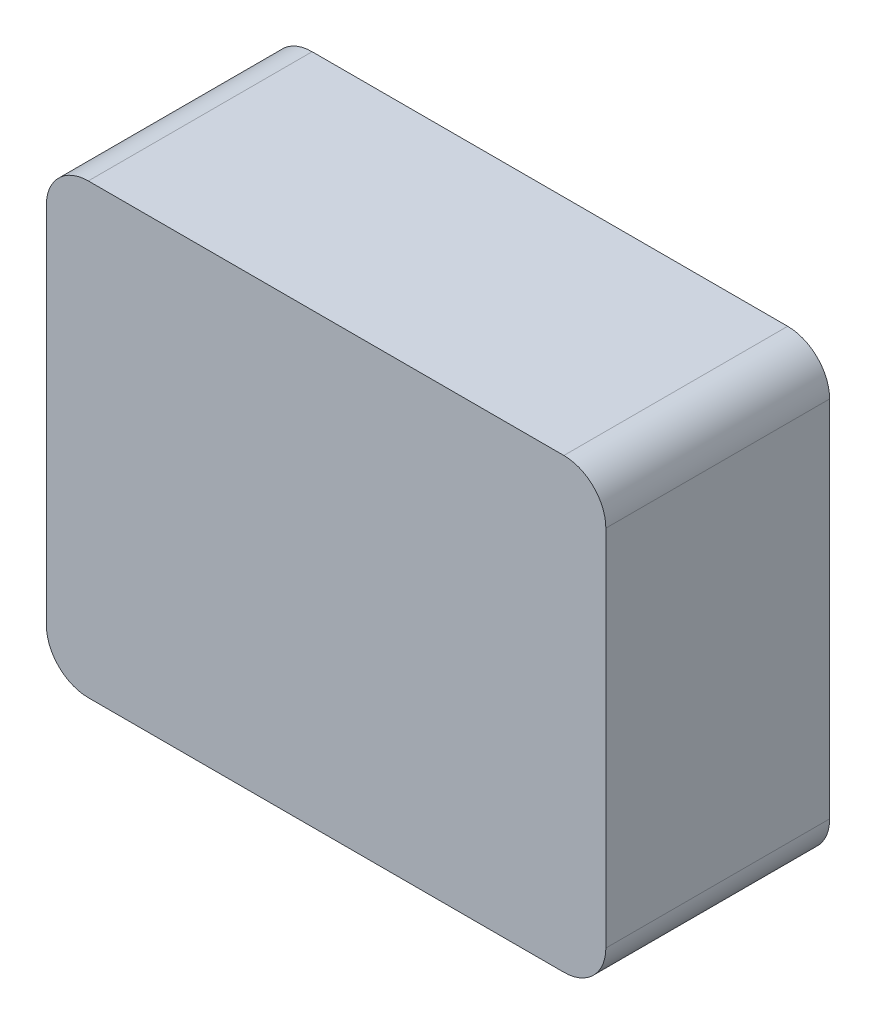
ISO-10303-21;
HEADER;
FILE_DESCRIPTION(('STEP AP214'),'2;1');
FILE_NAME('part.step','',(''),(''),'','','');
FILE_SCHEMA(('AUTOMOTIVE_DESIGN { 1 0 10303 214 1 1 1 1 }'));
ENDSEC;
DATA;
#1=APPLICATION_CONTEXT('core data for automotive mechanical design processes');
#2=APPLICATION_PROTOCOL_DEFINITION('international standard','automotive_design',2000,#1);
#3=PRODUCT_CONTEXT('',#1,'mechanical');
#4=PRODUCT('Part','Part','',(#3));
#5=PRODUCT_RELATED_PRODUCT_CATEGORY('part','',(#4));
#6=PRODUCT_DEFINITION_FORMATION('','',#4);
#7=PRODUCT_DEFINITION_CONTEXT('part definition',#1,'design');
#8=PRODUCT_DEFINITION('design','',#6,#7);
#9=PRODUCT_DEFINITION_SHAPE('','',#8);
#10=(LENGTH_UNIT() NAMED_UNIT(*) SI_UNIT(.MILLI.,.METRE.));
#11=(NAMED_UNIT(*) PLANE_ANGLE_UNIT() SI_UNIT($,.RADIAN.));
#12=(NAMED_UNIT(*) SI_UNIT($,.STERADIAN.) SOLID_ANGLE_UNIT());
#13=UNCERTAINTY_MEASURE_WITH_UNIT(LENGTH_MEASURE(1.E-05),#10,'distance_accuracy_value','');
#14=(GEOMETRIC_REPRESENTATION_CONTEXT(3) GLOBAL_UNCERTAINTY_ASSIGNED_CONTEXT((#13)) GLOBAL_UNIT_ASSIGNED_CONTEXT((#10,
#11,#12)) REPRESENTATION_CONTEXT('',''));
#15=CARTESIAN_POINT('',(0.,0.,0.));
#16=DIRECTION('',(0.,0.,1.));
#17=DIRECTION('',(1.,0.,0.));
#18=AXIS2_PLACEMENT_3D('',#15,#16,#17);
#19=CARTESIAN_POINT('',(0.,0.,50.7999999999997));
#20=DIRECTION('',(1.,0.,0.));
#21=DIRECTION('',(0.,0.,-0.999999999999997));
#22=AXIS2_PLACEMENT_3D('',#19,#20,#21);
#23=PLANE('',#22);
#24=DIRECTION('',(0.,-1.,0.));
#25=VECTOR('',#24,1.);
#26=CARTESIAN_POINT('',(0.,0.,50.7999999999997));
#27=LINE('',#26,#25);
#28=CARTESIAN_POINT('',(0.,92.075,50.7999999999997));
#29=VERTEX_POINT('',#28);
#30=CARTESIAN_POINT('',(0.,9.52500000000001,50.7999999999997));
#31=VERTEX_POINT('',#30);
#32=EDGE_CURVE('E117',#29,#31,#27,.T.);
#33=ORIENTED_EDGE('',*,*,#32,.F.);
#34=DIRECTION('',(0.,0.,-0.999999999999997));
#35=VECTOR('',#34,1.);
#36=CARTESIAN_POINT('',(0.,92.075,50.7999999999997));
#37=LINE('',#36,#35);
#38=CARTESIAN_POINT('',(0.,92.075,0.));
#39=VERTEX_POINT('',#38);
#40=EDGE_CURVE('E11',#29,#39,#37,.T.);
#41=ORIENTED_EDGE('',*,*,#40,.T.);
#42=DIRECTION('',(0.,-1.,0.));
#43=VECTOR('',#42,1.);
#44=CARTESIAN_POINT('',(0.,0.,0.));
#45=LINE('',#44,#43);
#46=CARTESIAN_POINT('',(0.,9.52500000000001,0.));
#47=VERTEX_POINT('',#46);
#48=EDGE_CURVE('E153',#39,#47,#45,.T.);
#49=ORIENTED_EDGE('',*,*,#48,.T.);
#50=DIRECTION('',(0.,0.,-0.999999999999997));
#51=VECTOR('',#50,1.);
#52=CARTESIAN_POINT('',(0.,9.52500000000001,50.7999999999997));
#53=LINE('',#52,#51);
#54=EDGE_CURVE('E31',#47,#31,#53,.F.);
#55=ORIENTED_EDGE('',*,*,#54,.T.);
#56=EDGE_LOOP('',(#33,#41,#49,#55));
#57=FACE_BOUND('',#56,.T.);
#58=ADVANCED_FACE('F24',(#57),#23,.F.);
#59=CARTESIAN_POINT('',(0.,0.,50.7999999999997));
#60=DIRECTION('',(0.,1.,0.));
#61=DIRECTION('',(0.,0.,0.999999999999997));
#62=AXIS2_PLACEMENT_3D('',#59,#60,#61);
#63=PLANE('',#62);
#64=DIRECTION('',(1.,0.,0.));
#65=VECTOR('',#64,1.);
#66=CARTESIAN_POINT('',(0.,0.,0.));
#67=LINE('',#66,#65);
#68=CARTESIAN_POINT('',(9.52500000000016,0.,0.));
#69=VERTEX_POINT('',#68);
#70=CARTESIAN_POINT('',(117.475,0.,0.));
#71=VERTEX_POINT('',#70);
#72=EDGE_CURVE('E122',#69,#71,#67,.T.);
#73=ORIENTED_EDGE('',*,*,#72,.T.);
#74=DIRECTION('',(0.,0.,-0.999999999999997));
#75=VECTOR('',#74,1.);
#76=CARTESIAN_POINT('',(117.475,0.,50.7999999999997));
#77=LINE('',#76,#75);
#78=CARTESIAN_POINT('',(117.475,0.,50.7999999999997));
#79=VERTEX_POINT('',#78);
#80=EDGE_CURVE('E38',#71,#79,#77,.F.);
#81=ORIENTED_EDGE('',*,*,#80,.T.);
#82=DIRECTION('',(1.,0.,0.));
#83=VECTOR('',#82,1.);
#84=CARTESIAN_POINT('',(0.,0.,50.7999999999997));
#85=LINE('',#84,#83);
#86=CARTESIAN_POINT('',(9.52500000000022,0.,50.7999999999997));
#87=VERTEX_POINT('',#86);
#88=EDGE_CURVE('E120',#87,#79,#85,.T.);
#89=ORIENTED_EDGE('',*,*,#88,.F.);
#90=DIRECTION('',(0.,0.,-0.999999999999997));
#91=VECTOR('',#90,1.);
#92=CARTESIAN_POINT('',(9.52500000000022,0.,50.7999999999997));
#93=LINE('',#92,#91);
#94=EDGE_CURVE('E145',#87,#69,#93,.T.);
#95=ORIENTED_EDGE('',*,*,#94,.T.);
#96=EDGE_LOOP('',(#73,#81,#89,#95));
#97=FACE_BOUND('',#96,.T.);
#98=ADVANCED_FACE('F160',(#97),#63,.F.);
#99=CARTESIAN_POINT('',(127.,0.,50.7999999999997));
#100=DIRECTION('',(-1.,0.,0.));
#101=DIRECTION('',(0.,0.,0.999999999999997));
#102=AXIS2_PLACEMENT_3D('',#99,#100,#101);
#103=PLANE('',#102);
#104=DIRECTION('',(0.,1.,0.));
#105=VECTOR('',#104,1.);
#106=CARTESIAN_POINT('',(127.,0.,0.));
#107=LINE('',#106,#105);
#108=CARTESIAN_POINT('',(127.,9.52500000000001,0.));
#109=VERTEX_POINT('',#108);
#110=CARTESIAN_POINT('',(127.,92.075,0.));
#111=VERTEX_POINT('',#110);
#112=EDGE_CURVE('E118',#109,#111,#107,.T.);
#113=ORIENTED_EDGE('',*,*,#112,.T.);
#114=DIRECTION('',(0.,0.,-0.999999999999997));
#115=VECTOR('',#114,1.);
#116=CARTESIAN_POINT('',(127.,92.075,50.7999999999997));
#117=LINE('',#116,#115);
#118=CARTESIAN_POINT('',(127.,92.075,50.7999999999997));
#119=VERTEX_POINT('',#118);
#120=EDGE_CURVE('E95',#111,#119,#117,.F.);
#121=ORIENTED_EDGE('',*,*,#120,.T.);
#122=DIRECTION('',(0.,1.,0.));
#123=VECTOR('',#122,1.);
#124=CARTESIAN_POINT('',(127.,0.,50.7999999999997));
#125=LINE('',#124,#123);
#126=CARTESIAN_POINT('',(127.,9.52500000000001,50.7999999999997));
#127=VERTEX_POINT('',#126);
#128=EDGE_CURVE('E127',#127,#119,#125,.T.);
#129=ORIENTED_EDGE('',*,*,#128,.F.);
#130=DIRECTION('',(0.,0.,-0.999999999999997));
#131=VECTOR('',#130,1.);
#132=CARTESIAN_POINT('',(127.,9.52500000000001,50.7999999999997));
#133=LINE('',#132,#131);
#134=EDGE_CURVE('E100',#127,#109,#133,.T.);
#135=ORIENTED_EDGE('',*,*,#134,.T.);
#136=EDGE_LOOP('',(#113,#121,#129,#135));
#137=FACE_BOUND('',#136,.T.);
#138=ADVANCED_FACE('F168',(#137),#103,.F.);
#139=CARTESIAN_POINT('',(0.,101.6,50.7999999999997));
#140=DIRECTION('',(0.,-1.,0.));
#141=DIRECTION('',(0.,0.,-0.999999999999997));
#142=AXIS2_PLACEMENT_3D('',#139,#140,#141);
#143=PLANE('',#142);
#144=DIRECTION('',(-1.,0.,0.));
#145=VECTOR('',#144,1.);
#146=CARTESIAN_POINT('',(0.,101.6,50.7999999999997));
#147=LINE('',#146,#145);
#148=CARTESIAN_POINT('',(117.475,101.6,50.7999999999997));
#149=VERTEX_POINT('',#148);
#150=CARTESIAN_POINT('',(9.52500000000011,101.6,50.7999999999995));
#151=VERTEX_POINT('',#150);
#152=EDGE_CURVE('E110',#149,#151,#147,.T.);
#153=ORIENTED_EDGE('',*,*,#152,.F.);
#154=DIRECTION('',(0.,0.,-0.999999999999997));
#155=VECTOR('',#154,1.);
#156=CARTESIAN_POINT('',(117.475,101.6,50.7999999999997));
#157=LINE('',#156,#155);
#158=CARTESIAN_POINT('',(117.475,101.6,0.));
#159=VERTEX_POINT('',#158);
#160=EDGE_CURVE('E94',#149,#159,#157,.T.);
#161=ORIENTED_EDGE('',*,*,#160,.T.);
#162=DIRECTION('',(-1.,0.,0.));
#163=VECTOR('',#162,1.);
#164=CARTESIAN_POINT('',(0.,101.6,0.));
#165=LINE('',#164,#163);
#166=CARTESIAN_POINT('',(9.52500000000001,101.6,-1.11022302462516E-13));
#167=VERTEX_POINT('',#166);
#168=EDGE_CURVE('E107',#159,#167,#165,.T.);
#169=ORIENTED_EDGE('',*,*,#168,.T.);
#170=DIRECTION('',(0.,0.,-0.999999999999997));
#171=VECTOR('',#170,1.);
#172=CARTESIAN_POINT('',(9.52500000000011,101.6,50.7999999999995));
#173=LINE('',#172,#171);
#174=EDGE_CURVE('E112',#167,#151,#173,.F.);
#175=ORIENTED_EDGE('',*,*,#174,.T.);
#176=EDGE_LOOP('',(#153,#161,#169,#175));
#177=FACE_BOUND('',#176,.T.);
#178=ADVANCED_FACE('F106',(#177),#143,.F.);
#179=CARTESIAN_POINT('',(0.,101.6,50.7999999999997));
#180=DIRECTION('',(0.,0.,-0.999999999999997));
#181=DIRECTION('',(-1.,0.,0.));
#182=AXIS2_PLACEMENT_3D('',#179,#180,#181);
#183=PLANE('',#182);
#184=ORIENTED_EDGE('',*,*,#128,.T.);
#185=CARTESIAN_POINT('',(117.475,92.075,50.7999999999997));
#186=DIRECTION('',(0.,0.,-0.999999999999997));
#187=DIRECTION('',(-1.,0.,0.));
#188=AXIS2_PLACEMENT_3D('',#185,#186,#187);
#189=CIRCLE('',#188,9.525);
#190=EDGE_CURVE('E143',#119,#149,#189,.F.);
#191=ORIENTED_EDGE('',*,*,#190,.T.);
#192=ORIENTED_EDGE('',*,*,#152,.T.);
#193=CARTESIAN_POINT('',(9.52500000000012,92.075,50.7999999999995));
#194=DIRECTION('',(0.,0.,-0.999999999999997));
#195=DIRECTION('',(-1.,0.,0.));
#196=AXIS2_PLACEMENT_3D('',#193,#194,#195);
#197=CIRCLE('',#196,9.525);
#198=EDGE_CURVE('E139',#151,#29,#197,.F.);
#199=ORIENTED_EDGE('',*,*,#198,.T.);
#200=ORIENTED_EDGE('',*,*,#32,.T.);
#201=CARTESIAN_POINT('',(9.52500000000021,9.52500000000001,50.7999999999997));
#202=DIRECTION('',(0.,0.,-0.999999999999997));
#203=DIRECTION('',(-1.,0.,0.));
#204=AXIS2_PLACEMENT_3D('',#201,#202,#203);
#205=CIRCLE('',#204,9.525);
#206=EDGE_CURVE('E45',#31,#87,#205,.F.);
#207=ORIENTED_EDGE('',*,*,#206,.T.);
#208=ORIENTED_EDGE('',*,*,#88,.T.);
#209=CARTESIAN_POINT('',(117.475,9.52500000000001,50.7999999999997));
#210=DIRECTION('',(0.,0.,-0.999999999999997));
#211=DIRECTION('',(-1.,0.,0.));
#212=AXIS2_PLACEMENT_3D('',#209,#210,#211);
#213=CIRCLE('',#212,9.525);
#214=EDGE_CURVE('E141',#79,#127,#213,.F.);
#215=ORIENTED_EDGE('',*,*,#214,.T.);
#216=EDGE_LOOP('',(#184,#191,#192,#199,#200,#207,#208,#215));
#217=FACE_BOUND('',#216,.T.);
#218=ADVANCED_FACE('F155',(#217),#183,.F.);
#219=CARTESIAN_POINT('',(0.,101.6,0.));
#220=DIRECTION('',(0.,0.,-0.999999999999997));
#221=DIRECTION('',(-1.,0.,0.));
#222=AXIS2_PLACEMENT_3D('',#219,#220,#221);
#223=PLANE('',#222);
#224=ORIENTED_EDGE('',*,*,#168,.F.);
#225=CARTESIAN_POINT('',(117.475,92.075,0.));
#226=DIRECTION('',(0.,0.,-0.999999999999997));
#227=DIRECTION('',(-1.,0.,0.));
#228=AXIS2_PLACEMENT_3D('',#225,#226,#227);
#229=CIRCLE('',#228,9.525);
#230=EDGE_CURVE('E90',#159,#111,#229,.T.);
#231=ORIENTED_EDGE('',*,*,#230,.T.);
#232=ORIENTED_EDGE('',*,*,#112,.F.);
#233=CARTESIAN_POINT('',(117.475,9.52500000000001,0.));
#234=DIRECTION('',(0.,0.,-0.999999999999997));
#235=DIRECTION('',(-1.,0.,0.));
#236=AXIS2_PLACEMENT_3D('',#233,#234,#235);
#237=CIRCLE('',#236,9.525);
#238=EDGE_CURVE('E101',#109,#71,#237,.T.);
#239=ORIENTED_EDGE('',*,*,#238,.T.);
#240=ORIENTED_EDGE('',*,*,#72,.F.);
#241=CARTESIAN_POINT('',(9.52500000000016,9.52500000000001,0.));
#242=DIRECTION('',(0.,0.,-0.999999999999997));
#243=DIRECTION('',(-1.,0.,0.));
#244=AXIS2_PLACEMENT_3D('',#241,#242,#243);
#245=CIRCLE('',#244,9.525);
#246=EDGE_CURVE('E111',#69,#47,#245,.T.);
#247=ORIENTED_EDGE('',*,*,#246,.T.);
#248=ORIENTED_EDGE('',*,*,#48,.F.);
#249=CARTESIAN_POINT('',(9.52500000000001,92.075,-1.11022302462516E-13));
#250=DIRECTION('',(0.,0.,-0.999999999999997));
#251=DIRECTION('',(-1.,0.,0.));
#252=AXIS2_PLACEMENT_3D('',#249,#250,#251);
#253=CIRCLE('',#252,9.525);
#254=EDGE_CURVE('E116',#39,#167,#253,.T.);
#255=ORIENTED_EDGE('',*,*,#254,.T.);
#256=EDGE_LOOP('',(#224,#231,#232,#239,#240,#247,#248,#255));
#257=FACE_BOUND('',#256,.T.);
#258=ADVANCED_FACE('F114',(#257),#223,.T.);
#259=CARTESIAN_POINT('',(117.475,92.075,50.7999999999997));
#260=DIRECTION('',(0.,0.,-0.999999999999997));
#261=DIRECTION('',(-1.,0.,0.));
#262=AXIS2_PLACEMENT_3D('',#259,#260,#261);
#263=CYLINDRICAL_SURFACE('',#262,9.525);
#264=ORIENTED_EDGE('',*,*,#190,.F.);
#265=ORIENTED_EDGE('',*,*,#120,.F.);
#266=ORIENTED_EDGE('',*,*,#230,.F.);
#267=ORIENTED_EDGE('',*,*,#160,.F.);
#268=EDGE_LOOP('',(#264,#265,#266,#267));
#269=FACE_BOUND('',#268,.T.);
#270=ADVANCED_FACE('F93',(#269),#263,.T.);
#271=CARTESIAN_POINT('',(117.475,9.52500000000001,50.7999999999997));
#272=DIRECTION('',(0.,0.,-0.999999999999997));
#273=DIRECTION('',(-1.,0.,0.));
#274=AXIS2_PLACEMENT_3D('',#271,#272,#273);
#275=CYLINDRICAL_SURFACE('',#274,9.525);
#276=ORIENTED_EDGE('',*,*,#214,.F.);
#277=ORIENTED_EDGE('',*,*,#80,.F.);
#278=ORIENTED_EDGE('',*,*,#238,.F.);
#279=ORIENTED_EDGE('',*,*,#134,.F.);
#280=EDGE_LOOP('',(#276,#277,#278,#279));
#281=FACE_BOUND('',#280,.T.);
#282=ADVANCED_FACE('F165',(#281),#275,.T.);
#283=CARTESIAN_POINT('',(9.52500000000012,92.075,50.7999999999995));
#284=DIRECTION('',(0.,0.,-0.999999999999997));
#285=DIRECTION('',(-1.,0.,0.));
#286=AXIS2_PLACEMENT_3D('',#283,#284,#285);
#287=CYLINDRICAL_SURFACE('',#286,9.525);
#288=ORIENTED_EDGE('',*,*,#198,.F.);
#289=ORIENTED_EDGE('',*,*,#174,.F.);
#290=ORIENTED_EDGE('',*,*,#254,.F.);
#291=ORIENTED_EDGE('',*,*,#40,.F.);
#292=EDGE_LOOP('',(#288,#289,#290,#291));
#293=FACE_BOUND('',#292,.T.);
#294=ADVANCED_FACE('F170',(#293),#287,.T.);
#295=CARTESIAN_POINT('',(9.52500000000021,9.52500000000001,50.7999999999997));
#296=DIRECTION('',(0.,0.,-0.999999999999997));
#297=DIRECTION('',(-1.,0.,0.));
#298=AXIS2_PLACEMENT_3D('',#295,#296,#297);
#299=CYLINDRICAL_SURFACE('',#298,9.525);
#300=ORIENTED_EDGE('',*,*,#206,.F.);
#301=ORIENTED_EDGE('',*,*,#54,.F.);
#302=ORIENTED_EDGE('',*,*,#246,.F.);
#303=ORIENTED_EDGE('',*,*,#94,.F.);
#304=EDGE_LOOP('',(#300,#301,#302,#303));
#305=FACE_BOUND('',#304,.T.);
#306=ADVANCED_FACE('F158',(#305),#299,.T.);
#307=CLOSED_SHELL('',(#58,#98,#138,#178,#218,#258,#270,#282,#294,#306));
#308=MANIFOLD_SOLID_BREP('B2',#307);
#309=ADVANCED_BREP_SHAPE_REPRESENTATION('',(#18,#308),#14);
#310=SHAPE_DEFINITION_REPRESENTATION(#9,#309);
ENDSEC;
END-ISO-10303-21;
